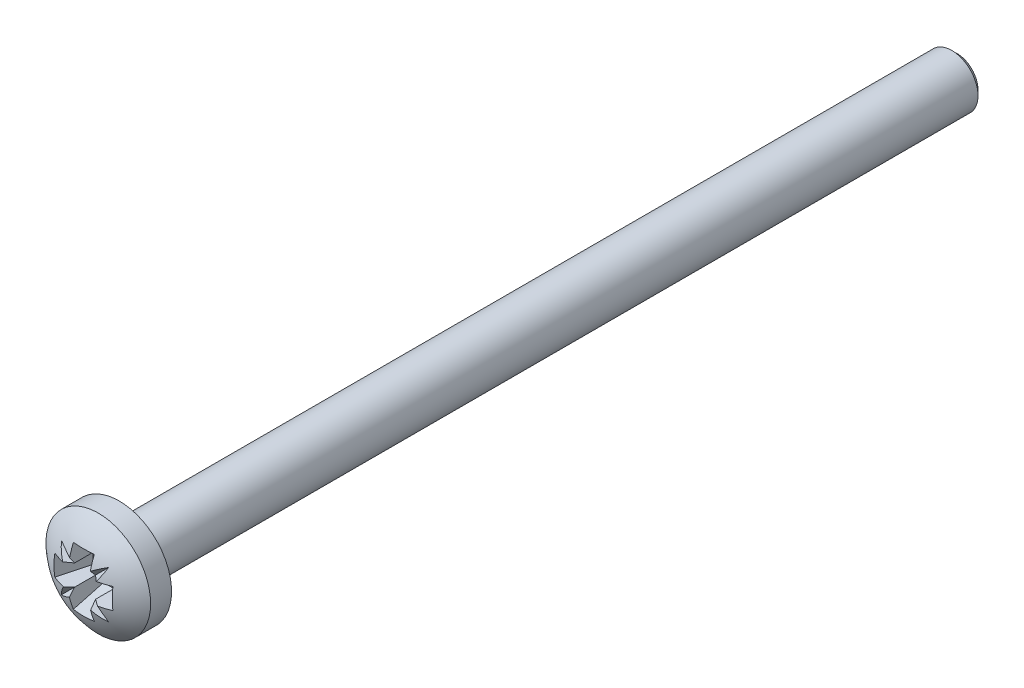
ISO-10303-21;
HEADER;
FILE_DESCRIPTION(('STEP AP214'),'2;1');
FILE_NAME('part.step','',(''),(''),'','','');
FILE_SCHEMA(('AUTOMOTIVE_DESIGN { 1 0 10303 214 1 1 1 1 }'));
ENDSEC;
DATA;
#1=APPLICATION_CONTEXT('core data for automotive mechanical design processes');
#2=APPLICATION_PROTOCOL_DEFINITION('international standard','automotive_design',2000,#1);
#3=PRODUCT_CONTEXT('',#1,'mechanical');
#4=PRODUCT('Part','Part','',(#3));
#5=PRODUCT_RELATED_PRODUCT_CATEGORY('part','',(#4));
#6=PRODUCT_DEFINITION_FORMATION('','',#4);
#7=PRODUCT_DEFINITION_CONTEXT('part definition',#1,'design');
#8=PRODUCT_DEFINITION('design','',#6,#7);
#9=PRODUCT_DEFINITION_SHAPE('','',#8);
#10=(LENGTH_UNIT() NAMED_UNIT(*) SI_UNIT(.MILLI.,.METRE.));
#11=(NAMED_UNIT(*) PLANE_ANGLE_UNIT() SI_UNIT($,.RADIAN.));
#12=(NAMED_UNIT(*) SI_UNIT($,.STERADIAN.) SOLID_ANGLE_UNIT());
#13=UNCERTAINTY_MEASURE_WITH_UNIT(LENGTH_MEASURE(1.E-05),#10,'distance_accuracy_value','');
#14=(GEOMETRIC_REPRESENTATION_CONTEXT(3) GLOBAL_UNCERTAINTY_ASSIGNED_CONTEXT((#13)) GLOBAL_UNIT_ASSIGNED_CONTEXT((#10,
#11,#12)) REPRESENTATION_CONTEXT('',''));
#15=CARTESIAN_POINT('',(0.,0.,0.));
#16=DIRECTION('',(0.,0.,1.));
#17=DIRECTION('',(1.,0.,0.));
#18=AXIS2_PLACEMENT_3D('',#15,#16,#17);
#19=CARTESIAN_POINT('',(0.,0.,0.));
#20=DIRECTION('',(0.,0.,1.));
#21=DIRECTION('',(1.,0.,0.));
#22=AXIS2_PLACEMENT_3D('',#19,#20,#21);
#23=PLANE('',#22);
#24=CARTESIAN_POINT('',(0.,0.,0.));
#25=DIRECTION('',(0.,0.,1.));
#26=DIRECTION('',(1.,0.,0.));
#27=AXIS2_PLACEMENT_3D('',#24,#25,#26);
#28=CIRCLE('',#27,2.5);
#29=CARTESIAN_POINT('',(2.5,0.,0.));
#30=VERTEX_POINT('',#29);
#31=EDGE_CURVE('E247',#30,#30,#28,.T.);
#32=ORIENTED_EDGE('',*,*,#31,.F.);
#33=EDGE_LOOP('',(#32));
#34=FACE_BOUND('',#33,.T.);
#35=CARTESIAN_POINT('',(0.,0.,0.));
#36=DIRECTION('',(0.,0.,1.));
#37=DIRECTION('',(1.,0.,0.));
#38=AXIS2_PLACEMENT_3D('',#35,#36,#37);
#39=CIRCLE('',#38,1.25);
#40=CARTESIAN_POINT('',(1.25,0.,0.));
#41=VERTEX_POINT('',#40);
#42=EDGE_CURVE('E264',#41,#41,#39,.F.);
#43=ORIENTED_EDGE('',*,*,#42,.F.);
#44=EDGE_LOOP('',(#43));
#45=FACE_BOUND('',#44,.T.);
#46=ADVANCED_FACE('F32',(#34,#45),#23,.F.);
#47=CARTESIAN_POINT('',(0.,0.,1.));
#48=DIRECTION('',(0.,0.,-1.));
#49=DIRECTION('',(-1.,0.,0.));
#50=AXIS2_PLACEMENT_3D('',#47,#48,#49);
#51=CYLINDRICAL_SURFACE('',#50,2.5);
#52=CARTESIAN_POINT('',(0.,0.,1.));
#53=DIRECTION('',(0.,0.,1.));
#54=DIRECTION('',(1.,0.,0.));
#55=AXIS2_PLACEMENT_3D('',#52,#53,#54);
#56=CIRCLE('',#55,2.5);
#57=CARTESIAN_POINT('',(2.5,0.,1.));
#58=VERTEX_POINT('',#57);
#59=EDGE_CURVE('E263',#58,#58,#56,.T.);
#60=ORIENTED_EDGE('',*,*,#59,.F.);
#61=EDGE_LOOP('',(#60));
#62=FACE_BOUND('',#61,.T.);
#63=ORIENTED_EDGE('',*,*,#31,.T.);
#64=EDGE_LOOP('',(#63));
#65=FACE_BOUND('',#64,.T.);
#66=ADVANCED_FACE('F390',(#62,#65),#51,.T.);
#67=CARTESIAN_POINT('',(0.,0.,-1.625));
#68=DIRECTION('',(0.,0.,1.));
#69=DIRECTION('',(1.,0.,0.));
#70=AXIS2_PLACEMENT_3D('',#67,#68,#69);
#71=SPHERICAL_SURFACE('',#70,3.625);
#72=CARTESIAN_POINT('',(-1.15094556789194,-1.15094556789194,0.00268283166649885));
#73=DIRECTION('',(0.499999999999922,0.499999999999921,-0.707106781186659));
#74=DIRECTION('',(-0.816496580927812,0.,-0.577350269189505));
#75=AXIS2_PLACEMENT_3D('',#72,#73,#74);
#76=CIRCLE('',#75,2.80034322878427);
#77=CARTESIAN_POINT('',(1.12765672923971,-1.12765672923971,1.63036566333197));
#78=VERTEX_POINT('',#77);
#79=CARTESIAN_POINT('',(0.834639062342882,-0.5,1.86699121356446));
#80=VERTEX_POINT('',#79);
#81=EDGE_CURVE('E47',#78,#80,#76,.F.);
#82=ORIENTED_EDGE('',*,*,#81,.F.);
#83=CARTESIAN_POINT('',(1.15094556789194,1.15094556789194,0.00268283166647934));
#84=DIRECTION('',(-0.499999999999924,-0.499999999999924,-0.707106781186655));
#85=DIRECTION('',(-0.816496580927809,0.,0.577350269189509));
#86=AXIS2_PLACEMENT_3D('',#83,#84,#85);
#87=CIRCLE('',#86,2.80034322878428);
#88=CARTESIAN_POINT('',(0.499999999999999,-0.834639062342882,1.86699121356446));
#89=VERTEX_POINT('',#88);
#90=EDGE_CURVE('E166',#89,#78,#87,.F.);
#91=ORIENTED_EDGE('',*,*,#90,.F.);
#92=CARTESIAN_POINT('',(0.5,0.,-1.625));
#93=DIRECTION('',(1.,0.,0.));
#94=DIRECTION('',(0.,1.,0.));
#95=AXIS2_PLACEMENT_3D('',#92,#93,#94);
#96=CIRCLE('',#95,3.59035165408627);
#97=CARTESIAN_POINT('',(0.5,-1.38514981453768,1.68739867638034));
#98=VERTEX_POINT('',#97);
#99=EDGE_CURVE('E277',#98,#89,#96,.F.);
#100=ORIENTED_EDGE('',*,*,#99,.F.);
#101=CARTESIAN_POINT('',(0.,-0.464262701892218,-1.74939881604791));
#102=DIRECTION('',(0.,0.965925826289068,0.258819045102521));
#103=DIRECTION('',(0.,-0.258819045102521,0.965925826289068));
#104=AXIS2_PLACEMENT_3D('',#101,#102,#103);
#105=CIRCLE('',#104,3.59299458365826);
#106=CARTESIAN_POINT('',(-0.5,-1.38514981453768,1.68739867638034));
#107=VERTEX_POINT('',#106);
#108=EDGE_CURVE('E294',#107,#98,#105,.T.);
#109=ORIENTED_EDGE('',*,*,#108,.F.);
#110=CARTESIAN_POINT('',(-0.5,0.,-1.625));
#111=DIRECTION('',(-1.,0.,0.));
#112=DIRECTION('',(0.,-1.,0.));
#113=AXIS2_PLACEMENT_3D('',#110,#111,#112);
#114=CIRCLE('',#113,3.59035165408627);
#115=CARTESIAN_POINT('',(-0.5,-0.781338878854619,1.8793022923815));
#116=VERTEX_POINT('',#115);
#117=EDGE_CURVE('E289',#116,#107,#114,.F.);
#118=ORIENTED_EDGE('',*,*,#117,.F.);
#119=CARTESIAN_POINT('',(-1.12260978110972,1.12260978110972,-0.356268361692934));
#120=DIRECTION('',(0.552387761143332,-0.552387761143333,-0.624288012601646));
#121=DIRECTION('',(0.,0.748917388741033,-0.662663372189313));
#122=AXIS2_PLACEMENT_3D('',#119,#120,#121);
#123=CIRCLE('',#122,3.00173942717756);
#124=CARTESIAN_POINT('',(-1.12765672923971,-1.1276567292397,1.63036566333197));
#125=VERTEX_POINT('',#124);
#126=EDGE_CURVE('E205',#125,#116,#123,.F.);
#127=ORIENTED_EDGE('',*,*,#126,.F.);
#128=CARTESIAN_POINT('',(1.12260978110972,-1.12260978110972,-0.356268361692927));
#129=DIRECTION('',(-0.552387761143332,0.552387761143332,-0.624288012601647));
#130=DIRECTION('',(0.,0.748917388741035,0.662663372189311));
#131=AXIS2_PLACEMENT_3D('',#128,#129,#130);
#132=CIRCLE('',#131,3.00173942717756);
#133=CARTESIAN_POINT('',(-0.781338878854624,-0.500000000000001,1.8793022923815));
#134=VERTEX_POINT('',#133);
#135=EDGE_CURVE('E199',#134,#125,#132,.F.);
#136=ORIENTED_EDGE('',*,*,#135,.F.);
#137=CARTESIAN_POINT('',(0.,-0.500000000000001,-1.625));
#138=DIRECTION('',(0.,-1.,0.));
#139=DIRECTION('',(1.,0.,0.));
#140=AXIS2_PLACEMENT_3D('',#137,#138,#139);
#141=CIRCLE('',#140,3.59035165408627);
#142=CARTESIAN_POINT('',(-1.38514981453768,-0.500000000000001,1.68739867638034));
#143=VERTEX_POINT('',#142);
#144=EDGE_CURVE('E285',#143,#134,#141,.F.);
#145=ORIENTED_EDGE('',*,*,#144,.F.);
#146=CARTESIAN_POINT('',(-0.464262701892218,0.,-1.74939881604791));
#147=DIRECTION('',(0.965925826289068,0.,0.258819045102521));
#148=DIRECTION('',(0.258819045102521,0.,-0.965925826289068));
#149=AXIS2_PLACEMENT_3D('',#146,#147,#148);
#150=CIRCLE('',#149,3.59299458365826);
#151=CARTESIAN_POINT('',(-1.38514981453768,0.500000000000001,1.68739867638034));
#152=VERTEX_POINT('',#151);
#153=EDGE_CURVE('E273',#152,#143,#150,.T.);
#154=ORIENTED_EDGE('',*,*,#153,.F.);
#155=CARTESIAN_POINT('',(0.,0.500000000000001,-1.625));
#156=DIRECTION('',(0.,1.,0.));
#157=DIRECTION('',(-1.,0.,0.));
#158=AXIS2_PLACEMENT_3D('',#155,#156,#157);
#159=CIRCLE('',#158,3.59035165408627);
#160=CARTESIAN_POINT('',(-0.834639062342883,0.500000000000001,1.86699121356446));
#161=VERTEX_POINT('',#160);
#162=EDGE_CURVE('E175',#161,#152,#159,.F.);
#163=ORIENTED_EDGE('',*,*,#162,.F.);
#164=CARTESIAN_POINT('',(-1.12765672923971,1.12765672923971,1.63036566333197));
#165=VERTEX_POINT('',#164);
#166=EDGE_CURVE('E55',#165,#161,#87,.F.);
#167=ORIENTED_EDGE('',*,*,#166,.F.);
#168=CARTESIAN_POINT('',(-0.5,0.834639062342885,1.86699121356446));
#169=VERTEX_POINT('',#168);
#170=EDGE_CURVE('E159',#169,#165,#76,.F.);
#171=ORIENTED_EDGE('',*,*,#170,.F.);
#172=CARTESIAN_POINT('',(-0.5,0.,-1.625));
#173=DIRECTION('',(-1.,0.,0.));
#174=DIRECTION('',(0.,-1.,0.));
#175=AXIS2_PLACEMENT_3D('',#172,#173,#174);
#176=CIRCLE('',#175,3.59035165408627);
#177=CARTESIAN_POINT('',(-0.5,1.38514981453768,1.68739867638034));
#178=VERTEX_POINT('',#177);
#179=EDGE_CURVE('E284',#178,#169,#176,.F.);
#180=ORIENTED_EDGE('',*,*,#179,.F.);
#181=CARTESIAN_POINT('',(0.,0.464262701892218,-1.74939881604791));
#182=DIRECTION('',(0.,-0.965925826289068,0.258819045102521));
#183=DIRECTION('',(0.,-0.258819045102521,-0.965925826289068));
#184=AXIS2_PLACEMENT_3D('',#181,#182,#183);
#185=CIRCLE('',#184,3.59299458365826);
#186=CARTESIAN_POINT('',(0.5,1.38514981453768,1.68739867638034));
#187=VERTEX_POINT('',#186);
#188=EDGE_CURVE('E291',#187,#178,#185,.T.);
#189=ORIENTED_EDGE('',*,*,#188,.F.);
#190=CARTESIAN_POINT('',(0.5,0.,-1.625));
#191=DIRECTION('',(1.,0.,0.));
#192=DIRECTION('',(0.,1.,0.));
#193=AXIS2_PLACEMENT_3D('',#190,#191,#192);
#194=CIRCLE('',#193,3.59035165408627);
#195=CARTESIAN_POINT('',(0.5,0.78133887885462,1.8793022923815));
#196=VERTEX_POINT('',#195);
#197=EDGE_CURVE('E282',#196,#187,#194,.F.);
#198=ORIENTED_EDGE('',*,*,#197,.F.);
#199=CARTESIAN_POINT('',(1.12765672923971,1.12765672923971,1.63036566333197));
#200=VERTEX_POINT('',#199);
#201=EDGE_CURVE('E196',#200,#196,#132,.F.);
#202=ORIENTED_EDGE('',*,*,#201,.F.);
#203=CARTESIAN_POINT('',(0.781338878854622,0.5,1.8793022923815));
#204=VERTEX_POINT('',#203);
#205=EDGE_CURVE('E202',#204,#200,#123,.F.);
#206=ORIENTED_EDGE('',*,*,#205,.F.);
#207=CARTESIAN_POINT('',(0.,0.5,-1.625));
#208=DIRECTION('',(0.,1.,0.));
#209=DIRECTION('',(-1.,0.,0.));
#210=AXIS2_PLACEMENT_3D('',#207,#208,#209);
#211=CIRCLE('',#210,3.59035165408627);
#212=CARTESIAN_POINT('',(1.38514981453768,0.499999999999999,1.68739867638034));
#213=VERTEX_POINT('',#212);
#214=EDGE_CURVE('E279',#213,#204,#211,.F.);
#215=ORIENTED_EDGE('',*,*,#214,.F.);
#216=CARTESIAN_POINT('',(0.464262701892218,0.,-1.74939881604791));
#217=DIRECTION('',(-0.965925826289068,0.,0.258819045102521));
#218=DIRECTION('',(0.258819045102521,0.,0.965925826289068));
#219=AXIS2_PLACEMENT_3D('',#216,#217,#218);
#220=CIRCLE('',#219,3.59299458365826);
#221=CARTESIAN_POINT('',(1.38514981453768,-0.499999999999999,1.68739867638034));
#222=VERTEX_POINT('',#221);
#223=EDGE_CURVE('E278',#222,#213,#220,.T.);
#224=ORIENTED_EDGE('',*,*,#223,.F.);
#225=CARTESIAN_POINT('',(0.,-0.5,-1.625));
#226=DIRECTION('',(0.,-1.,0.));
#227=DIRECTION('',(1.,0.,0.));
#228=AXIS2_PLACEMENT_3D('',#225,#226,#227);
#229=CIRCLE('',#228,3.59035165408627);
#230=EDGE_CURVE('E189',#80,#222,#229,.F.);
#231=ORIENTED_EDGE('',*,*,#230,.F.);
#232=EDGE_LOOP('',(#82,#91,#100,#109,#118,#127,#136,#145,#154,#163,#167,#171,#180,#189,#198,
#202,#206,#215,#224,#231));
#233=FACE_BOUND('',#232,.T.);
#234=ORIENTED_EDGE('',*,*,#59,.T.);
#235=EDGE_LOOP('',(#234));
#236=FACE_BOUND('',#235,.T.);
#237=ADVANCED_FACE('F172',(#233,#236),#71,.T.);
#238=CARTESIAN_POINT('',(0.,0.,-40.));
#239=DIRECTION('',(0.,0.,1.));
#240=DIRECTION('',(1.,0.,0.));
#241=AXIS2_PLACEMENT_3D('',#238,#239,#240);
#242=CYLINDRICAL_SURFACE('',#241,1.25);
#243=CARTESIAN_POINT('',(0.,0.,-39.75));
#244=DIRECTION('',(0.,0.,-1.));
#245=DIRECTION('',(-1.,0.,0.));
#246=AXIS2_PLACEMENT_3D('',#243,#244,#245);
#247=CIRCLE('',#246,1.25);
#248=CARTESIAN_POINT('',(-1.25,0.,-39.75));
#249=VERTEX_POINT('',#248);
#250=EDGE_CURVE('E270',#249,#249,#247,.F.);
#251=ORIENTED_EDGE('',*,*,#250,.T.);
#252=EDGE_LOOP('',(#251));
#253=FACE_BOUND('',#252,.T.);
#254=ORIENTED_EDGE('',*,*,#42,.T.);
#255=EDGE_LOOP('',(#254));
#256=FACE_BOUND('',#255,.T.);
#257=ADVANCED_FACE('F401',(#253,#256),#242,.T.);
#258=CARTESIAN_POINT('',(0.,0.,-40.));
#259=DIRECTION('',(0.,0.,-1.));
#260=DIRECTION('',(-1.,0.,0.));
#261=AXIS2_PLACEMENT_3D('',#258,#259,#260);
#262=PLANE('',#261);
#263=CARTESIAN_POINT('',(0.,0.,-40.));
#264=DIRECTION('',(0.,0.,-1.));
#265=DIRECTION('',(-1.,0.,0.));
#266=AXIS2_PLACEMENT_3D('',#263,#264,#265);
#267=CIRCLE('',#266,0.999999999999999);
#268=CARTESIAN_POINT('',(-0.999999999999999,0.,-40.));
#269=VERTEX_POINT('',#268);
#270=EDGE_CURVE('E267',#269,#269,#267,.T.);
#271=ORIENTED_EDGE('',*,*,#270,.T.);
#272=EDGE_LOOP('',(#271));
#273=FACE_BOUND('',#272,.T.);
#274=ADVANCED_FACE('F426',(#273),#262,.T.);
#275=CARTESIAN_POINT('',(0.,0.,-40.));
#276=DIRECTION('',(0.,0.,1.));
#277=DIRECTION('',(1.,0.,0.));
#278=AXIS2_PLACEMENT_3D('',#275,#276,#277);
#279=CONICAL_SURFACE('',#278,0.999999999999999,0.785398163397448);
#280=ORIENTED_EDGE('',*,*,#250,.F.);
#281=EDGE_LOOP('',(#280));
#282=FACE_BOUND('',#281,.T.);
#283=ORIENTED_EDGE('',*,*,#270,.F.);
#284=EDGE_LOOP('',(#283));
#285=FACE_BOUND('',#284,.T.);
#286=ADVANCED_FACE('F424',(#282,#285),#279,.T.);
#287=CARTESIAN_POINT('',(-0.5,-0.500000000000001,2.));
#288=DIRECTION('',(0.,-1.,0.));
#289=DIRECTION('',(1.,0.,0.));
#290=AXIS2_PLACEMENT_3D('',#287,#288,#289);
#291=PLANE('',#290);
#292=ORIENTED_EDGE('',*,*,#144,.T.);
#293=DIRECTION('',(0.748917388741035,0.,-0.662663372189311));
#294=VECTOR('',#293,1.);
#295=CARTESIAN_POINT('',(-0.683442173813192,-0.500000000000001,1.79268050783723));
#296=LINE('',#295,#294);
#297=CARTESIAN_POINT('',(-0.5,-0.499999999999999,1.63036566333197));
#298=VERTEX_POINT('',#297);
#299=EDGE_CURVE('E198',#134,#298,#296,.T.);
#300=ORIENTED_EDGE('',*,*,#299,.T.);
#301=DIRECTION('',(0.,0.,-1.));
#302=VECTOR('',#301,1.);
#303=CARTESIAN_POINT('',(-0.5,-0.500000000000001,2.));
#304=LINE('',#303,#302);
#305=CARTESIAN_POINT('',(-0.5,-0.500000000000001,0.25));
#306=VERTEX_POINT('',#305);
#307=EDGE_CURVE('E245',#298,#306,#304,.T.);
#308=ORIENTED_EDGE('',*,*,#307,.T.);
#309=DIRECTION('',(-1.,0.,0.));
#310=VECTOR('',#309,1.);
#311=CARTESIAN_POINT('',(-0.5,-0.500000000000001,0.25));
#312=LINE('',#311,#310);
#313=CARTESIAN_POINT('',(-1.,-0.500000000000001,0.25));
#314=VERTEX_POINT('',#313);
#315=EDGE_CURVE('E208',#306,#314,#312,.T.);
#316=ORIENTED_EDGE('',*,*,#315,.T.);
#317=DIRECTION('',(-0.258819045102521,0.,0.965925826289068));
#318=VECTOR('',#317,1.);
#319=CARTESIAN_POINT('',(-1.40400635094611,-0.500000000000001,1.75777222831138));
#320=LINE('',#319,#318);
#321=EDGE_CURVE('E244',#143,#314,#320,.F.);
#322=ORIENTED_EDGE('',*,*,#321,.F.);
#323=EDGE_LOOP('',(#292,#300,#308,#316,#322));
#324=FACE_BOUND('',#323,.T.);
#325=ADVANCED_FACE('F378',(#324),#291,.F.);
#326=CARTESIAN_POINT('',(-0.5,-1.,2.));
#327=DIRECTION('',(-1.,0.,0.));
#328=DIRECTION('',(0.,-1.,0.));
#329=AXIS2_PLACEMENT_3D('',#326,#327,#328);
#330=PLANE('',#329);
#331=ORIENTED_EDGE('',*,*,#307,.F.);
#332=DIRECTION('',(0.,-0.748917388741033,0.662663372189313));
#333=VECTOR('',#332,1.);
#334=CARTESIAN_POINT('',(-0.5,-0.963880801392535,2.04082056899441));
#335=LINE('',#334,#333);
#336=EDGE_CURVE('E204',#298,#116,#335,.T.);
#337=ORIENTED_EDGE('',*,*,#336,.T.);
#338=ORIENTED_EDGE('',*,*,#117,.T.);
#339=DIRECTION('',(0.,-0.258819045102521,0.965925826289068));
#340=VECTOR('',#339,1.);
#341=CARTESIAN_POINT('',(-0.5,-1.,0.25));
#342=LINE('',#341,#340);
#343=CARTESIAN_POINT('',(-0.5,-1.,0.25));
#344=VERTEX_POINT('',#343);
#345=EDGE_CURVE('E248',#107,#344,#342,.F.);
#346=ORIENTED_EDGE('',*,*,#345,.T.);
#347=DIRECTION('',(0.,1.,0.));
#348=VECTOR('',#347,1.);
#349=CARTESIAN_POINT('',(-0.5,-1.,0.25));
#350=LINE('',#349,#348);
#351=EDGE_CURVE('E241',#344,#306,#350,.T.);
#352=ORIENTED_EDGE('',*,*,#351,.T.);
#353=EDGE_LOOP('',(#331,#337,#338,#346,#352));
#354=FACE_BOUND('',#353,.T.);
#355=ADVANCED_FACE('F369',(#354),#330,.F.);
#356=CARTESIAN_POINT('',(-0.5,-1.,0.25));
#357=DIRECTION('',(0.,0.965925826289068,0.258819045102521));
#358=DIRECTION('',(0.,-0.258819045102521,0.965925826289068));
#359=AXIS2_PLACEMENT_3D('',#356,#357,#358);
#360=PLANE('',#359);
#361=ORIENTED_EDGE('',*,*,#108,.T.);
#362=DIRECTION('',(0.,-0.258819045102521,0.965925826289068));
#363=VECTOR('',#362,1.);
#364=CARTESIAN_POINT('',(0.5,-1.4375,1.88277222831138));
#365=LINE('',#364,#363);
#366=CARTESIAN_POINT('',(0.5,-1.,0.25));
#367=VERTEX_POINT('',#366);
#368=EDGE_CURVE('E251',#98,#367,#365,.F.);
#369=ORIENTED_EDGE('',*,*,#368,.T.);
#370=DIRECTION('',(-1.,0.,0.));
#371=VECTOR('',#370,1.);
#372=CARTESIAN_POINT('',(-0.5,-1.,0.25));
#373=LINE('',#372,#371);
#374=EDGE_CURVE('E238',#367,#344,#373,.T.);
#375=ORIENTED_EDGE('',*,*,#374,.T.);
#376=ORIENTED_EDGE('',*,*,#345,.F.);
#377=EDGE_LOOP('',(#361,#369,#375,#376));
#378=FACE_BOUND('',#377,.T.);
#379=ADVANCED_FACE('F366',(#378),#360,.T.);
#380=CARTESIAN_POINT('',(0.5,-1.,2.));
#381=DIRECTION('',(1.,0.,0.));
#382=DIRECTION('',(0.,1.,0.));
#383=AXIS2_PLACEMENT_3D('',#380,#381,#382);
#384=PLANE('',#383);
#385=ORIENTED_EDGE('',*,*,#99,.T.);
#386=DIRECTION('',(0.,0.816496580927809,-0.577350269189509));
#387=VECTOR('',#386,1.);
#388=CARTESIAN_POINT('',(0.5,-1.00758063067829,1.98927936928342));
#389=LINE('',#388,#387);
#390=CARTESIAN_POINT('',(0.499999999999997,-0.499999999999999,1.63036566333197));
#391=VERTEX_POINT('',#390);
#392=EDGE_CURVE('E176',#89,#391,#389,.T.);
#393=ORIENTED_EDGE('',*,*,#392,.T.);
#394=DIRECTION('',(0.,0.,-1.));
#395=VECTOR('',#394,1.);
#396=CARTESIAN_POINT('',(0.5,-0.5,2.));
#397=LINE('',#396,#395);
#398=CARTESIAN_POINT('',(0.5,-0.5,0.25));
#399=VERTEX_POINT('',#398);
#400=EDGE_CURVE('E249',#391,#399,#397,.T.);
#401=ORIENTED_EDGE('',*,*,#400,.T.);
#402=DIRECTION('',(0.,-1.,0.));
#403=VECTOR('',#402,1.);
#404=CARTESIAN_POINT('',(0.5,-1.,0.25));
#405=LINE('',#404,#403);
#406=EDGE_CURVE('E235',#399,#367,#405,.T.);
#407=ORIENTED_EDGE('',*,*,#406,.T.);
#408=ORIENTED_EDGE('',*,*,#368,.F.);
#409=EDGE_LOOP('',(#385,#393,#401,#407,#408));
#410=FACE_BOUND('',#409,.T.);
#411=ADVANCED_FACE('F360',(#410),#384,.F.);
#412=CARTESIAN_POINT('',(0.5,-0.5,2.));
#413=DIRECTION('',(0.,-1.,0.));
#414=DIRECTION('',(1.,0.,0.));
#415=AXIS2_PLACEMENT_3D('',#412,#413,#414);
#416=PLANE('',#415);
#417=ORIENTED_EDGE('',*,*,#400,.F.);
#418=DIRECTION('',(0.816496580927812,0.,0.577350269189505));
#419=VECTOR('',#418,1.);
#420=CARTESIAN_POINT('',(0.674247297344883,-0.5,1.75357710888793));
#421=LINE('',#420,#419);
#422=EDGE_CURVE('E165',#391,#80,#421,.T.);
#423=ORIENTED_EDGE('',*,*,#422,.T.);
#424=ORIENTED_EDGE('',*,*,#230,.T.);
#425=DIRECTION('',(0.258819045102521,0.,0.965925826289068));
#426=VECTOR('',#425,1.);
#427=CARTESIAN_POINT('',(1.,-0.5,0.25));
#428=LINE('',#427,#426);
#429=CARTESIAN_POINT('',(1.,-0.499999999999999,0.25));
#430=VERTEX_POINT('',#429);
#431=EDGE_CURVE('E252',#222,#430,#428,.F.);
#432=ORIENTED_EDGE('',*,*,#431,.T.);
#433=DIRECTION('',(-1.,0.,0.));
#434=VECTOR('',#433,1.);
#435=CARTESIAN_POINT('',(0.5,-0.5,0.25));
#436=LINE('',#435,#434);
#437=EDGE_CURVE('E232',#430,#399,#436,.T.);
#438=ORIENTED_EDGE('',*,*,#437,.T.);
#439=EDGE_LOOP('',(#417,#423,#424,#432,#438));
#440=FACE_BOUND('',#439,.T.);
#441=ADVANCED_FACE('F354',(#440),#416,.F.);
#442=CARTESIAN_POINT('',(1.,0.499999999999999,0.25));
#443=DIRECTION('',(-0.965925826289068,0.,0.258819045102521));
#444=DIRECTION('',(0.258819045102521,0.,0.965925826289068));
#445=AXIS2_PLACEMENT_3D('',#442,#443,#444);
#446=PLANE('',#445);
#447=ORIENTED_EDGE('',*,*,#223,.T.);
#448=DIRECTION('',(0.258819045102521,0.,0.965925826289068));
#449=VECTOR('',#448,1.);
#450=CARTESIAN_POINT('',(1.40400635094611,0.499999999999999,1.75777222831138));
#451=LINE('',#450,#449);
#452=CARTESIAN_POINT('',(1.,0.499999999999999,0.25));
#453=VERTEX_POINT('',#452);
#454=EDGE_CURVE('E255',#213,#453,#451,.F.);
#455=ORIENTED_EDGE('',*,*,#454,.T.);
#456=DIRECTION('',(0.,-1.,0.));
#457=VECTOR('',#456,1.);
#458=CARTESIAN_POINT('',(1.,0.499999999999999,0.25));
#459=LINE('',#458,#457);
#460=EDGE_CURVE('E229',#453,#430,#459,.T.);
#461=ORIENTED_EDGE('',*,*,#460,.T.);
#462=ORIENTED_EDGE('',*,*,#431,.F.);
#463=EDGE_LOOP('',(#447,#455,#461,#462));
#464=FACE_BOUND('',#463,.T.);
#465=ADVANCED_FACE('F349',(#464),#446,.T.);
#466=CARTESIAN_POINT('',(0.5,0.5,2.));
#467=DIRECTION('',(0.,1.,0.));
#468=DIRECTION('',(-1.,0.,0.));
#469=AXIS2_PLACEMENT_3D('',#466,#467,#468);
#470=PLANE('',#469);
#471=ORIENTED_EDGE('',*,*,#214,.T.);
#472=DIRECTION('',(-0.748917388741034,0.,-0.662663372189312));
#473=VECTOR('',#472,1.);
#474=CARTESIAN_POINT('',(0.683442173813191,0.5,1.79268050783723));
#475=LINE('',#474,#473);
#476=CARTESIAN_POINT('',(0.499999999999999,0.499999999999998,1.63036566333197));
#477=VERTEX_POINT('',#476);
#478=EDGE_CURVE('E310',#204,#477,#475,.T.);
#479=ORIENTED_EDGE('',*,*,#478,.T.);
#480=DIRECTION('',(0.,0.,-1.));
#481=VECTOR('',#480,1.);
#482=CARTESIAN_POINT('',(0.5,0.5,2.));
#483=LINE('',#482,#481);
#484=CARTESIAN_POINT('',(0.5,0.5,0.25));
#485=VERTEX_POINT('',#484);
#486=EDGE_CURVE('E253',#477,#485,#483,.T.);
#487=ORIENTED_EDGE('',*,*,#486,.T.);
#488=DIRECTION('',(1.,0.,0.));
#489=VECTOR('',#488,1.);
#490=CARTESIAN_POINT('',(0.5,0.5,0.25));
#491=LINE('',#490,#489);
#492=EDGE_CURVE('E226',#485,#453,#491,.T.);
#493=ORIENTED_EDGE('',*,*,#492,.T.);
#494=ORIENTED_EDGE('',*,*,#454,.F.);
#495=EDGE_LOOP('',(#471,#479,#487,#493,#494));
#496=FACE_BOUND('',#495,.T.);
#497=ADVANCED_FACE('F344',(#496),#470,.F.);
#498=CARTESIAN_POINT('',(0.5,1.,2.));
#499=DIRECTION('',(1.,0.,0.));
#500=DIRECTION('',(0.,1.,0.));
#501=AXIS2_PLACEMENT_3D('',#498,#499,#500);
#502=PLANE('',#501);
#503=ORIENTED_EDGE('',*,*,#486,.F.);
#504=DIRECTION('',(0.,0.748917388741035,0.662663372189311));
#505=VECTOR('',#504,1.);
#506=CARTESIAN_POINT('',(0.5,0.963880801392536,2.04082056899441));
#507=LINE('',#506,#505);
#508=EDGE_CURVE('E288',#477,#196,#507,.T.);
#509=ORIENTED_EDGE('',*,*,#508,.T.);
#510=ORIENTED_EDGE('',*,*,#197,.T.);
#511=DIRECTION('',(0.,0.258819045102521,0.965925826289068));
#512=VECTOR('',#511,1.);
#513=CARTESIAN_POINT('',(0.5,1.,0.25));
#514=LINE('',#513,#512);
#515=CARTESIAN_POINT('',(0.5,1.,0.25));
#516=VERTEX_POINT('',#515);
#517=EDGE_CURVE('E256',#187,#516,#514,.F.);
#518=ORIENTED_EDGE('',*,*,#517,.T.);
#519=DIRECTION('',(0.,-1.,0.));
#520=VECTOR('',#519,1.);
#521=CARTESIAN_POINT('',(0.5,1.,0.25));
#522=LINE('',#521,#520);
#523=EDGE_CURVE('E223',#516,#485,#522,.T.);
#524=ORIENTED_EDGE('',*,*,#523,.T.);
#525=EDGE_LOOP('',(#503,#509,#510,#518,#524));
#526=FACE_BOUND('',#525,.T.);
#527=ADVANCED_FACE('F337',(#526),#502,.F.);
#528=CARTESIAN_POINT('',(-0.5,1.,0.25));
#529=DIRECTION('',(0.,-0.965925826289068,0.258819045102521));
#530=DIRECTION('',(0.,-0.258819045102521,-0.965925826289068));
#531=AXIS2_PLACEMENT_3D('',#528,#529,#530);
#532=PLANE('',#531);
#533=ORIENTED_EDGE('',*,*,#188,.T.);
#534=DIRECTION('',(0.,0.258819045102521,0.965925826289068));
#535=VECTOR('',#534,1.);
#536=CARTESIAN_POINT('',(-0.5,1.4375,1.88277222831138));
#537=LINE('',#536,#535);
#538=CARTESIAN_POINT('',(-0.5,1.,0.25));
#539=VERTEX_POINT('',#538);
#540=EDGE_CURVE('E259',#178,#539,#537,.F.);
#541=ORIENTED_EDGE('',*,*,#540,.T.);
#542=DIRECTION('',(1.,0.,0.));
#543=VECTOR('',#542,1.);
#544=CARTESIAN_POINT('',(-0.5,1.,0.25));
#545=LINE('',#544,#543);
#546=EDGE_CURVE('E220',#539,#516,#545,.T.);
#547=ORIENTED_EDGE('',*,*,#546,.T.);
#548=ORIENTED_EDGE('',*,*,#517,.F.);
#549=EDGE_LOOP('',(#533,#541,#547,#548));
#550=FACE_BOUND('',#549,.T.);
#551=ADVANCED_FACE('F330',(#550),#532,.T.);
#552=CARTESIAN_POINT('',(-0.5,1.,2.));
#553=DIRECTION('',(-1.,0.,0.));
#554=DIRECTION('',(0.,-1.,0.));
#555=AXIS2_PLACEMENT_3D('',#552,#553,#554);
#556=PLANE('',#555);
#557=ORIENTED_EDGE('',*,*,#179,.T.);
#558=DIRECTION('',(0.,-0.816496580927812,-0.577350269189504));
#559=VECTOR('',#558,1.);
#560=CARTESIAN_POINT('',(-0.5,1.00758063067829,1.98927936928342));
#561=LINE('',#560,#559);
#562=CARTESIAN_POINT('',(-0.500000000000001,0.500000000000001,1.63036566333197));
#563=VERTEX_POINT('',#562);
#564=EDGE_CURVE('E11',#169,#563,#561,.T.);
#565=ORIENTED_EDGE('',*,*,#564,.T.);
#566=DIRECTION('',(0.,0.,-1.));
#567=VECTOR('',#566,1.);
#568=CARTESIAN_POINT('',(-0.5,0.500000000000001,2.));
#569=LINE('',#568,#567);
#570=CARTESIAN_POINT('',(-0.5,0.500000000000001,0.25));
#571=VERTEX_POINT('',#570);
#572=EDGE_CURVE('E257',#563,#571,#569,.T.);
#573=ORIENTED_EDGE('',*,*,#572,.T.);
#574=DIRECTION('',(0.,1.,0.));
#575=VECTOR('',#574,1.);
#576=CARTESIAN_POINT('',(-0.5,1.,0.25));
#577=LINE('',#576,#575);
#578=EDGE_CURVE('E217',#571,#539,#577,.T.);
#579=ORIENTED_EDGE('',*,*,#578,.T.);
#580=ORIENTED_EDGE('',*,*,#540,.F.);
#581=EDGE_LOOP('',(#557,#565,#573,#579,#580));
#582=FACE_BOUND('',#581,.T.);
#583=ADVANCED_FACE('F319',(#582),#556,.F.);
#584=CARTESIAN_POINT('',(-0.5,0.500000000000001,2.));
#585=DIRECTION('',(0.,1.,0.));
#586=DIRECTION('',(-1.,0.,0.));
#587=AXIS2_PLACEMENT_3D('',#584,#585,#586);
#588=PLANE('',#587);
#589=ORIENTED_EDGE('',*,*,#572,.F.);
#590=DIRECTION('',(-0.816496580927808,0.,0.577350269189509));
#591=VECTOR('',#590,1.);
#592=CARTESIAN_POINT('',(-0.674247297344885,0.500000000000001,1.75357710888793));
#593=LINE('',#592,#591);
#594=EDGE_CURVE('E40',#563,#161,#593,.T.);
#595=ORIENTED_EDGE('',*,*,#594,.T.);
#596=ORIENTED_EDGE('',*,*,#162,.T.);
#597=DIRECTION('',(-0.258819045102521,0.,0.965925826289068));
#598=VECTOR('',#597,1.);
#599=CARTESIAN_POINT('',(-1.,0.500000000000001,0.25));
#600=LINE('',#599,#598);
#601=CARTESIAN_POINT('',(-1.,0.500000000000001,0.25));
#602=VERTEX_POINT('',#601);
#603=EDGE_CURVE('E260',#152,#602,#600,.F.);
#604=ORIENTED_EDGE('',*,*,#603,.T.);
#605=DIRECTION('',(1.,0.,0.));
#606=VECTOR('',#605,1.);
#607=CARTESIAN_POINT('',(-0.5,0.500000000000001,0.25));
#608=LINE('',#607,#606);
#609=EDGE_CURVE('E214',#602,#571,#608,.T.);
#610=ORIENTED_EDGE('',*,*,#609,.T.);
#611=EDGE_LOOP('',(#589,#595,#596,#604,#610));
#612=FACE_BOUND('',#611,.T.);
#613=ADVANCED_FACE('F314',(#612),#588,.F.);
#614=CARTESIAN_POINT('',(-1.,0.500000000000001,0.25));
#615=DIRECTION('',(0.965925826289068,0.,0.258819045102521));
#616=DIRECTION('',(0.258819045102521,0.,-0.965925826289068));
#617=AXIS2_PLACEMENT_3D('',#614,#615,#616);
#618=PLANE('',#617);
#619=ORIENTED_EDGE('',*,*,#153,.T.);
#620=ORIENTED_EDGE('',*,*,#321,.T.);
#621=DIRECTION('',(0.,1.,0.));
#622=VECTOR('',#621,1.);
#623=CARTESIAN_POINT('',(-1.,0.500000000000001,0.25));
#624=LINE('',#623,#622);
#625=EDGE_CURVE('E211',#314,#602,#624,.T.);
#626=ORIENTED_EDGE('',*,*,#625,.T.);
#627=ORIENTED_EDGE('',*,*,#603,.F.);
#628=EDGE_LOOP('',(#619,#620,#626,#627));
#629=FACE_BOUND('',#628,.T.);
#630=ADVANCED_FACE('F34',(#629),#618,.T.);
#631=CARTESIAN_POINT('',(0.499999999999999,-0.500000000000002,0.25));
#632=DIRECTION('',(0.,0.,1.));
#633=DIRECTION('',(1.,0.,0.));
#634=AXIS2_PLACEMENT_3D('',#631,#632,#633);
#635=PLANE('',#634);
#636=ORIENTED_EDGE('',*,*,#315,.F.);
#637=ORIENTED_EDGE('',*,*,#351,.F.);
#638=ORIENTED_EDGE('',*,*,#374,.F.);
#639=ORIENTED_EDGE('',*,*,#406,.F.);
#640=ORIENTED_EDGE('',*,*,#437,.F.);
#641=ORIENTED_EDGE('',*,*,#460,.F.);
#642=ORIENTED_EDGE('',*,*,#492,.F.);
#643=ORIENTED_EDGE('',*,*,#523,.F.);
#644=ORIENTED_EDGE('',*,*,#546,.F.);
#645=ORIENTED_EDGE('',*,*,#578,.F.);
#646=ORIENTED_EDGE('',*,*,#609,.F.);
#647=ORIENTED_EDGE('',*,*,#625,.F.);
#648=EDGE_LOOP('',(#636,#637,#638,#639,#640,#641,#642,#643,#644,#645,#646,#647));
#649=FACE_BOUND('',#648,.T.);
#650=ADVANCED_FACE('F324',(#649),#635,.T.);
#651=CARTESIAN_POINT('',(-2.64066943942731,-2.35933056057269,1.8793022923815));
#652=DIRECTION('',(-0.552387761143332,0.552387761143332,-0.624288012601647));
#653=DIRECTION('',(0.,0.748917388741035,0.662663372189311));
#654=AXIS2_PLACEMENT_3D('',#651,#652,#653);
#655=PLANE('',#654);
#656=ORIENTED_EDGE('',*,*,#201,.T.);
#657=ORIENTED_EDGE('',*,*,#508,.F.);
#658=DIRECTION('',(0.707106781186548,0.707106781186547,0.));
#659=VECTOR('',#658,1.);
#660=CARTESIAN_POINT('',(-2.5,-2.5,1.63036566333197));
#661=LINE('',#660,#659);
#662=EDGE_CURVE('E190',#477,#200,#661,.T.);
#663=ORIENTED_EDGE('',*,*,#662,.T.);
#664=EDGE_LOOP('',(#656,#657,#663));
#665=FACE_BOUND('',#664,.T.);
#666=ADVANCED_FACE('F340',(#665),#655,.F.);
#667=CARTESIAN_POINT('',(-2.35933056057269,-2.64066943942731,1.8793022923815));
#668=DIRECTION('',(0.552387761143332,-0.552387761143333,-0.624288012601646));
#669=DIRECTION('',(0.,0.748917388741033,-0.662663372189313));
#670=AXIS2_PLACEMENT_3D('',#667,#668,#669);
#671=PLANE('',#670);
#672=ORIENTED_EDGE('',*,*,#205,.T.);
#673=ORIENTED_EDGE('',*,*,#662,.F.);
#674=ORIENTED_EDGE('',*,*,#478,.F.);
#675=EDGE_LOOP('',(#672,#673,#674));
#676=FACE_BOUND('',#675,.T.);
#677=ADVANCED_FACE('F342',(#676),#671,.F.);
#678=ORIENTED_EDGE('',*,*,#126,.T.);
#679=ORIENTED_EDGE('',*,*,#336,.F.);
#680=EDGE_CURVE('E192',#125,#298,#661,.T.);
#681=ORIENTED_EDGE('',*,*,#680,.F.);
#682=EDGE_LOOP('',(#678,#679,#681));
#683=FACE_BOUND('',#682,.T.);
#684=ADVANCED_FACE('F373',(#683),#671,.F.);
#685=ORIENTED_EDGE('',*,*,#135,.T.);
#686=ORIENTED_EDGE('',*,*,#680,.T.);
#687=ORIENTED_EDGE('',*,*,#299,.F.);
#688=EDGE_LOOP('',(#685,#686,#687));
#689=FACE_BOUND('',#688,.T.);
#690=ADVANCED_FACE('F375',(#689),#655,.F.);
#691=CARTESIAN_POINT('',(-2.66731953117144,2.33268046882856,1.86699121356446));
#692=DIRECTION('',(-0.499999999999924,-0.499999999999924,-0.707106781186655));
#693=DIRECTION('',(-0.816496580927809,0.,0.577350269189509));
#694=AXIS2_PLACEMENT_3D('',#691,#692,#693);
#695=PLANE('',#694);
#696=ORIENTED_EDGE('',*,*,#166,.T.);
#697=ORIENTED_EDGE('',*,*,#594,.F.);
#698=DIRECTION('',(0.707106781186547,-0.707106781186548,0.));
#699=VECTOR('',#698,1.);
#700=CARTESIAN_POINT('',(-2.5,2.5,1.63036566333197));
#701=LINE('',#700,#699);
#702=EDGE_CURVE('E161',#165,#563,#701,.T.);
#703=ORIENTED_EDGE('',*,*,#702,.F.);
#704=EDGE_LOOP('',(#696,#697,#703));
#705=FACE_BOUND('',#704,.T.);
#706=ADVANCED_FACE('F168',(#705),#695,.F.);
#707=CARTESIAN_POINT('',(-2.33268046882856,2.66731953117145,1.86699121356446));
#708=DIRECTION('',(0.499999999999922,0.499999999999921,-0.707106781186659));
#709=DIRECTION('',(-0.816496580927812,0.,-0.577350269189505));
#710=AXIS2_PLACEMENT_3D('',#707,#708,#709);
#711=PLANE('',#710);
#712=ORIENTED_EDGE('',*,*,#170,.T.);
#713=ORIENTED_EDGE('',*,*,#702,.T.);
#714=ORIENTED_EDGE('',*,*,#564,.F.);
#715=EDGE_LOOP('',(#712,#713,#714));
#716=FACE_BOUND('',#715,.T.);
#717=ADVANCED_FACE('F160',(#716),#711,.F.);
#718=ORIENTED_EDGE('',*,*,#81,.T.);
#719=ORIENTED_EDGE('',*,*,#422,.F.);
#720=EDGE_CURVE('E169',#391,#78,#701,.T.);
#721=ORIENTED_EDGE('',*,*,#720,.T.);
#722=EDGE_LOOP('',(#718,#719,#721));
#723=FACE_BOUND('',#722,.T.);
#724=ADVANCED_FACE('F186',(#723),#711,.F.);
#725=ORIENTED_EDGE('',*,*,#90,.T.);
#726=ORIENTED_EDGE('',*,*,#720,.F.);
#727=ORIENTED_EDGE('',*,*,#392,.F.);
#728=EDGE_LOOP('',(#725,#726,#727));
#729=FACE_BOUND('',#728,.T.);
#730=ADVANCED_FACE('F183',(#729),#695,.F.);
#731=CLOSED_SHELL('',(#46,#66,#237,#257,#274,#286,#325,#355,#379,#411,#441,#465,#497,#527,#551,
#583,#613,#630,#650,#666,#677,#684,#690,#706,#717,#724,#730));
#732=MANIFOLD_SOLID_BREP('B2',#731);
#733=ADVANCED_BREP_SHAPE_REPRESENTATION('',(#18,#732),#14);
#734=SHAPE_DEFINITION_REPRESENTATION(#9,#733);
ENDSEC;
END-ISO-10303-21;
